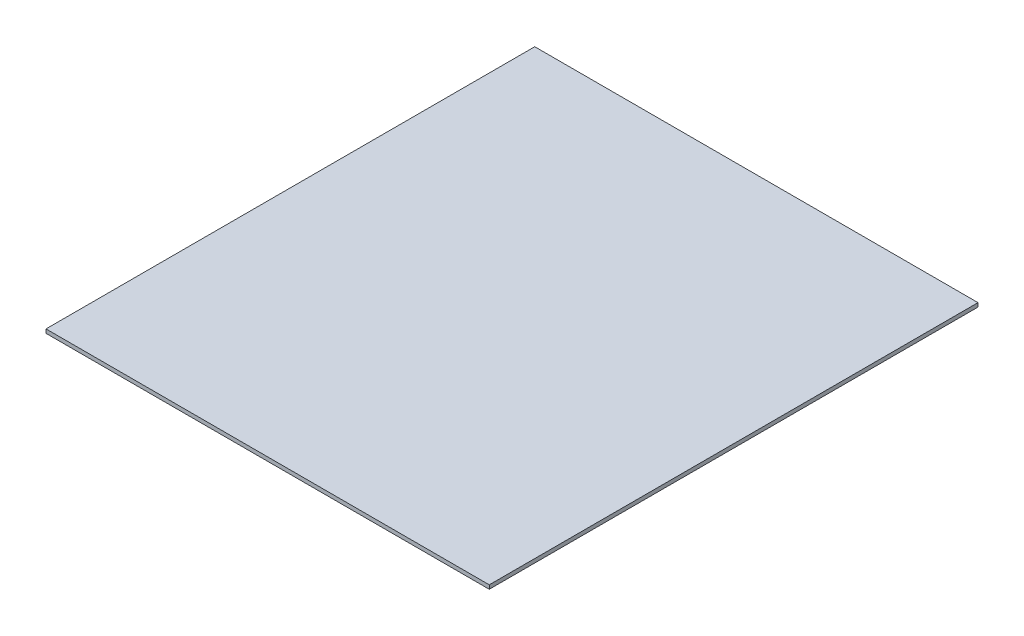
ISO-10303-21;
HEADER;
FILE_DESCRIPTION(('STEP AP214'),'2;1');
FILE_NAME('part.step','',(''),(''),'','','');
FILE_SCHEMA(('AUTOMOTIVE_DESIGN { 1 0 10303 214 1 1 1 1 }'));
ENDSEC;
DATA;
#1=APPLICATION_CONTEXT('core data for automotive mechanical design processes');
#2=APPLICATION_PROTOCOL_DEFINITION('international standard','automotive_design',2000,#1);
#3=PRODUCT_CONTEXT('',#1,'mechanical');
#4=PRODUCT('Part','Part','',(#3));
#5=PRODUCT_RELATED_PRODUCT_CATEGORY('part','',(#4));
#6=PRODUCT_DEFINITION_FORMATION('','',#4);
#7=PRODUCT_DEFINITION_CONTEXT('part definition',#1,'design');
#8=PRODUCT_DEFINITION('design','',#6,#7);
#9=PRODUCT_DEFINITION_SHAPE('','',#8);
#10=(LENGTH_UNIT() NAMED_UNIT(*) SI_UNIT(.MILLI.,.METRE.));
#11=(NAMED_UNIT(*) PLANE_ANGLE_UNIT() SI_UNIT($,.RADIAN.));
#12=(NAMED_UNIT(*) SI_UNIT($,.STERADIAN.) SOLID_ANGLE_UNIT());
#13=UNCERTAINTY_MEASURE_WITH_UNIT(LENGTH_MEASURE(1.E-05),#10,'distance_accuracy_value','');
#14=(GEOMETRIC_REPRESENTATION_CONTEXT(3) GLOBAL_UNCERTAINTY_ASSIGNED_CONTEXT((#13)) GLOBAL_UNIT_ASSIGNED_CONTEXT((#10,
#11,#12)) REPRESENTATION_CONTEXT('',''));
#15=CARTESIAN_POINT('',(0.,0.,0.));
#16=DIRECTION('',(0.,0.,1.));
#17=DIRECTION('',(1.,0.,0.));
#18=AXIS2_PLACEMENT_3D('',#15,#16,#17);
#19=CARTESIAN_POINT('',(0.,4.,0.));
#20=DIRECTION('',(1.,0.,0.));
#21=DIRECTION('',(0.,0.,-1.));
#22=AXIS2_PLACEMENT_3D('',#19,#20,#21);
#23=PLANE('',#22);
#24=DIRECTION('',(0.,0.,1.));
#25=VECTOR('',#24,1.);
#26=CARTESIAN_POINT('',(0.,0.,0.));
#27=LINE('',#26,#25);
#28=CARTESIAN_POINT('',(0.,0.,-505.));
#29=VERTEX_POINT('',#28);
#30=CARTESIAN_POINT('',(0.,0.,0.));
#31=VERTEX_POINT('',#30);
#32=EDGE_CURVE('E97',#29,#31,#27,.T.);
#33=ORIENTED_EDGE('',*,*,#32,.T.);
#34=DIRECTION('',(0.,-1.,0.));
#35=VECTOR('',#34,1.);
#36=CARTESIAN_POINT('',(0.,4.,0.));
#37=LINE('',#36,#35);
#38=CARTESIAN_POINT('',(0.,4.,0.));
#39=VERTEX_POINT('',#38);
#40=EDGE_CURVE('E11',#39,#31,#37,.T.);
#41=ORIENTED_EDGE('',*,*,#40,.F.);
#42=DIRECTION('',(0.,0.,1.));
#43=VECTOR('',#42,1.);
#44=CARTESIAN_POINT('',(0.,4.,0.));
#45=LINE('',#44,#43);
#46=CARTESIAN_POINT('',(0.,4.,-505.));
#47=VERTEX_POINT('',#46);
#48=EDGE_CURVE('E85',#47,#39,#45,.T.);
#49=ORIENTED_EDGE('',*,*,#48,.F.);
#50=DIRECTION('',(0.,-1.,0.));
#51=VECTOR('',#50,1.);
#52=CARTESIAN_POINT('',(0.,4.,-505.));
#53=LINE('',#52,#51);
#54=EDGE_CURVE('E93',#47,#29,#53,.T.);
#55=ORIENTED_EDGE('',*,*,#54,.T.);
#56=EDGE_LOOP('',(#33,#41,#49,#55));
#57=FACE_BOUND('',#56,.T.);
#58=ADVANCED_FACE('F34',(#57),#23,.F.);
#59=CARTESIAN_POINT('',(0.,4.,0.));
#60=DIRECTION('',(0.,0.,-1.));
#61=DIRECTION('',(-1.,0.,0.));
#62=AXIS2_PLACEMENT_3D('',#59,#60,#61);
#63=PLANE('',#62);
#64=DIRECTION('',(1.,0.,0.));
#65=VECTOR('',#64,1.);
#66=CARTESIAN_POINT('',(0.,0.,0.));
#67=LINE('',#66,#65);
#68=CARTESIAN_POINT('',(458.,0.,0.));
#69=VERTEX_POINT('',#68);
#70=EDGE_CURVE('E89',#31,#69,#67,.T.);
#71=ORIENTED_EDGE('',*,*,#70,.T.);
#72=DIRECTION('',(0.,-1.,0.));
#73=VECTOR('',#72,1.);
#74=CARTESIAN_POINT('',(458.,4.,0.));
#75=LINE('',#74,#73);
#76=CARTESIAN_POINT('',(458.,4.,0.));
#77=VERTEX_POINT('',#76);
#78=EDGE_CURVE('E42',#77,#69,#75,.T.);
#79=ORIENTED_EDGE('',*,*,#78,.F.);
#80=DIRECTION('',(1.,0.,0.));
#81=VECTOR('',#80,1.);
#82=CARTESIAN_POINT('',(0.,4.,0.));
#83=LINE('',#82,#81);
#84=EDGE_CURVE('E80',#39,#77,#83,.T.);
#85=ORIENTED_EDGE('',*,*,#84,.F.);
#86=ORIENTED_EDGE('',*,*,#40,.T.);
#87=EDGE_LOOP('',(#71,#79,#85,#86));
#88=FACE_BOUND('',#87,.T.);
#89=ADVANCED_FACE('F88',(#88),#63,.F.);
#90=CARTESIAN_POINT('',(458.,4.,0.));
#91=DIRECTION('',(-1.,0.,0.));
#92=DIRECTION('',(0.,0.,1.));
#93=AXIS2_PLACEMENT_3D('',#90,#91,#92);
#94=PLANE('',#93);
#95=DIRECTION('',(0.,0.,-1.));
#96=VECTOR('',#95,1.);
#97=CARTESIAN_POINT('',(458.,0.,0.));
#98=LINE('',#97,#96);
#99=CARTESIAN_POINT('',(458.,0.,-505.));
#100=VERTEX_POINT('',#99);
#101=EDGE_CURVE('E67',#69,#100,#98,.T.);
#102=ORIENTED_EDGE('',*,*,#101,.T.);
#103=DIRECTION('',(0.,-1.,0.));
#104=VECTOR('',#103,1.);
#105=CARTESIAN_POINT('',(458.,4.,-505.));
#106=LINE('',#105,#104);
#107=CARTESIAN_POINT('',(458.,4.,-505.));
#108=VERTEX_POINT('',#107);
#109=EDGE_CURVE('E90',#108,#100,#106,.T.);
#110=ORIENTED_EDGE('',*,*,#109,.F.);
#111=DIRECTION('',(0.,0.,-1.));
#112=VECTOR('',#111,1.);
#113=CARTESIAN_POINT('',(458.,4.,0.));
#114=LINE('',#113,#112);
#115=EDGE_CURVE('E83',#77,#108,#114,.T.);
#116=ORIENTED_EDGE('',*,*,#115,.F.);
#117=ORIENTED_EDGE('',*,*,#78,.T.);
#118=EDGE_LOOP('',(#102,#110,#116,#117));
#119=FACE_BOUND('',#118,.T.);
#120=ADVANCED_FACE('F91',(#119),#94,.F.);
#121=CARTESIAN_POINT('',(0.,4.,-505.));
#122=DIRECTION('',(0.,0.,1.));
#123=DIRECTION('',(1.,0.,0.));
#124=AXIS2_PLACEMENT_3D('',#121,#122,#123);
#125=PLANE('',#124);
#126=DIRECTION('',(-1.,0.,0.));
#127=VECTOR('',#126,1.);
#128=CARTESIAN_POINT('',(0.,0.,-505.));
#129=LINE('',#128,#127);
#130=EDGE_CURVE('E73',#100,#29,#129,.T.);
#131=ORIENTED_EDGE('',*,*,#130,.T.);
#132=ORIENTED_EDGE('',*,*,#54,.F.);
#133=DIRECTION('',(-1.,0.,0.));
#134=VECTOR('',#133,1.);
#135=CARTESIAN_POINT('',(0.,4.,-505.));
#136=LINE('',#135,#134);
#137=EDGE_CURVE('E50',#108,#47,#136,.T.);
#138=ORIENTED_EDGE('',*,*,#137,.F.);
#139=ORIENTED_EDGE('',*,*,#109,.T.);
#140=EDGE_LOOP('',(#131,#132,#138,#139));
#141=FACE_BOUND('',#140,.T.);
#142=ADVANCED_FACE('F104',(#141),#125,.F.);
#143=CARTESIAN_POINT('',(0.,4.,0.));
#144=DIRECTION('',(0.,-1.,0.));
#145=DIRECTION('',(0.,0.,-1.));
#146=AXIS2_PLACEMENT_3D('',#143,#144,#145);
#147=PLANE('',#146);
#148=ORIENTED_EDGE('',*,*,#48,.T.);
#149=ORIENTED_EDGE('',*,*,#84,.T.);
#150=ORIENTED_EDGE('',*,*,#115,.T.);
#151=ORIENTED_EDGE('',*,*,#137,.T.);
#152=EDGE_LOOP('',(#148,#149,#150,#151));
#153=FACE_BOUND('',#152,.T.);
#154=ADVANCED_FACE('F81',(#153),#147,.F.);
#155=CARTESIAN_POINT('',(0.,0.,0.));
#156=DIRECTION('',(0.,-1.,0.));
#157=DIRECTION('',(0.,0.,-1.));
#158=AXIS2_PLACEMENT_3D('',#155,#156,#157);
#159=PLANE('',#158);
#160=ORIENTED_EDGE('',*,*,#32,.F.);
#161=ORIENTED_EDGE('',*,*,#130,.F.);
#162=ORIENTED_EDGE('',*,*,#101,.F.);
#163=ORIENTED_EDGE('',*,*,#70,.F.);
#164=EDGE_LOOP('',(#160,#161,#162,#163));
#165=FACE_BOUND('',#164,.T.);
#166=ADVANCED_FACE('F107',(#165),#159,.T.);
#167=CLOSED_SHELL('',(#58,#89,#120,#142,#154,#166));
#168=MANIFOLD_SOLID_BREP('B2',#167);
#169=ADVANCED_BREP_SHAPE_REPRESENTATION('',(#18,#168),#14);
#170=SHAPE_DEFINITION_REPRESENTATION(#9,#169);
ENDSEC;
END-ISO-10303-21;
